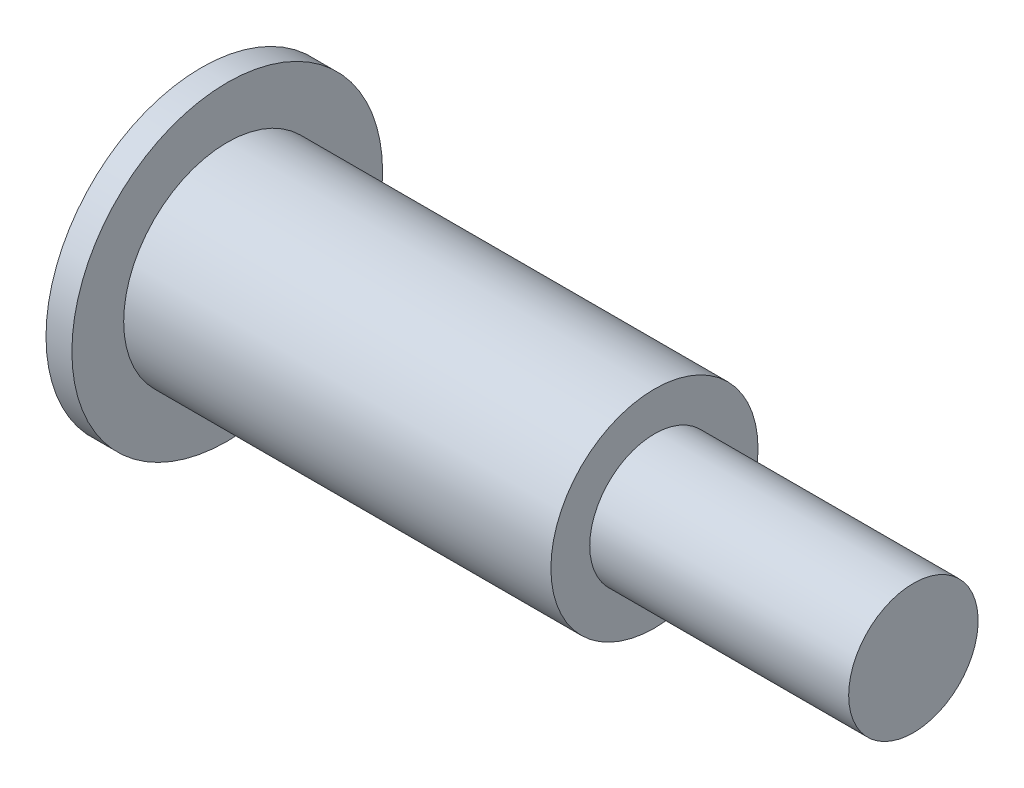
ISO-10303-21;
HEADER;
FILE_DESCRIPTION(('STEP AP214'),'2;1');
FILE_NAME('part.step','',(''),(''),'','','');
FILE_SCHEMA(('AUTOMOTIVE_DESIGN { 1 0 10303 214 1 1 1 1 }'));
ENDSEC;
DATA;
#1=APPLICATION_CONTEXT('core data for automotive mechanical design processes');
#2=APPLICATION_PROTOCOL_DEFINITION('international standard','automotive_design',2000,#1);
#3=PRODUCT_CONTEXT('',#1,'mechanical');
#4=PRODUCT('Part','Part','',(#3));
#5=PRODUCT_RELATED_PRODUCT_CATEGORY('part','',(#4));
#6=PRODUCT_DEFINITION_FORMATION('','',#4);
#7=PRODUCT_DEFINITION_CONTEXT('part definition',#1,'design');
#8=PRODUCT_DEFINITION('design','',#6,#7);
#9=PRODUCT_DEFINITION_SHAPE('','',#8);
#10=(LENGTH_UNIT() NAMED_UNIT(*) SI_UNIT(.MILLI.,.METRE.));
#11=(NAMED_UNIT(*) PLANE_ANGLE_UNIT() SI_UNIT($,.RADIAN.));
#12=(NAMED_UNIT(*) SI_UNIT($,.STERADIAN.) SOLID_ANGLE_UNIT());
#13=UNCERTAINTY_MEASURE_WITH_UNIT(LENGTH_MEASURE(1.E-05),#10,'distance_accuracy_value','');
#14=(GEOMETRIC_REPRESENTATION_CONTEXT(3) GLOBAL_UNCERTAINTY_ASSIGNED_CONTEXT((#13)) GLOBAL_UNIT_ASSIGNED_CONTEXT((#10,
#11,#12)) REPRESENTATION_CONTEXT('',''));
#15=CARTESIAN_POINT('',(0.,0.,0.));
#16=DIRECTION('',(0.,0.,1.));
#17=DIRECTION('',(1.,0.,0.));
#18=AXIS2_PLACEMENT_3D('',#15,#16,#17);
#19=CARTESIAN_POINT('',(0.,0.,0.));
#20=DIRECTION('',(1.,0.,0.));
#21=DIRECTION('',(0.,0.,-1.));
#22=AXIS2_PLACEMENT_3D('',#19,#20,#21);
#23=PLANE('',#22);
#24=CARTESIAN_POINT('',(0.,0.,0.));
#25=DIRECTION('',(-1.,0.,0.));
#26=DIRECTION('',(0.,0.,1.));
#27=AXIS2_PLACEMENT_3D('',#24,#25,#26);
#28=CIRCLE('',#27,6.);
#29=CARTESIAN_POINT('',(0.,0.,6.));
#30=VERTEX_POINT('',#29);
#31=EDGE_CURVE('E10',#30,#30,#28,.T.);
#32=ORIENTED_EDGE('',*,*,#31,.T.);
#33=EDGE_LOOP('',(#32));
#34=FACE_BOUND('',#33,.T.);
#35=ADVANCED_FACE('F29',(#34),#23,.F.);
#36=CARTESIAN_POINT('',(0.,0.,0.));
#37=DIRECTION('',(-1.,0.,0.));
#38=DIRECTION('',(0.,0.,1.));
#39=AXIS2_PLACEMENT_3D('',#36,#37,#38);
#40=CYLINDRICAL_SURFACE('',#39,6.);
#41=ORIENTED_EDGE('',*,*,#31,.F.);
#42=EDGE_LOOP('',(#41));
#43=FACE_BOUND('',#42,.T.);
#44=CARTESIAN_POINT('',(1.,0.,0.));
#45=DIRECTION('',(-1.,0.,0.));
#46=DIRECTION('',(0.,0.,1.));
#47=AXIS2_PLACEMENT_3D('',#44,#45,#46);
#48=CIRCLE('',#47,6.);
#49=CARTESIAN_POINT('',(1.,0.,6.));
#50=VERTEX_POINT('',#49);
#51=EDGE_CURVE('E35',#50,#50,#48,.T.);
#52=ORIENTED_EDGE('',*,*,#51,.T.);
#53=EDGE_LOOP('',(#52));
#54=FACE_BOUND('',#53,.T.);
#55=ADVANCED_FACE('F67',(#43,#54),#40,.T.);
#56=CARTESIAN_POINT('',(1.,6.,0.));
#57=DIRECTION('',(-1.,0.,0.));
#58=DIRECTION('',(0.,0.,1.));
#59=AXIS2_PLACEMENT_3D('',#56,#57,#58);
#60=PLANE('',#59);
#61=ORIENTED_EDGE('',*,*,#51,.F.);
#62=EDGE_LOOP('',(#61));
#63=FACE_BOUND('',#62,.T.);
#64=CARTESIAN_POINT('',(1.,0.,0.));
#65=DIRECTION('',(-1.,0.,0.));
#66=DIRECTION('',(0.,0.,1.));
#67=AXIS2_PLACEMENT_3D('',#64,#65,#66);
#68=CIRCLE('',#67,4.);
#69=CARTESIAN_POINT('',(1.,0.,4.));
#70=VERTEX_POINT('',#69);
#71=EDGE_CURVE('E39',#70,#70,#68,.T.);
#72=ORIENTED_EDGE('',*,*,#71,.T.);
#73=EDGE_LOOP('',(#72));
#74=FACE_BOUND('',#73,.T.);
#75=ADVANCED_FACE('F71',(#63,#74),#60,.F.);
#76=CARTESIAN_POINT('',(0.,0.,0.));
#77=DIRECTION('',(-1.,0.,0.));
#78=DIRECTION('',(0.,0.,1.));
#79=AXIS2_PLACEMENT_3D('',#76,#77,#78);
#80=CYLINDRICAL_SURFACE('',#79,4.);
#81=ORIENTED_EDGE('',*,*,#71,.F.);
#82=EDGE_LOOP('',(#81));
#83=FACE_BOUND('',#82,.T.);
#84=CARTESIAN_POINT('',(17.5,0.,0.));
#85=DIRECTION('',(-1.,0.,0.));
#86=DIRECTION('',(0.,0.,1.));
#87=AXIS2_PLACEMENT_3D('',#84,#85,#86);
#88=CIRCLE('',#87,4.);
#89=CARTESIAN_POINT('',(17.5,0.,4.));
#90=VERTEX_POINT('',#89);
#91=EDGE_CURVE('E43',#90,#90,#88,.T.);
#92=ORIENTED_EDGE('',*,*,#91,.T.);
#93=EDGE_LOOP('',(#92));
#94=FACE_BOUND('',#93,.T.);
#95=ADVANCED_FACE('F76',(#83,#94),#80,.T.);
#96=CARTESIAN_POINT('',(17.5,4.,0.));
#97=DIRECTION('',(-1.,0.,0.));
#98=DIRECTION('',(0.,0.,1.));
#99=AXIS2_PLACEMENT_3D('',#96,#97,#98);
#100=PLANE('',#99);
#101=ORIENTED_EDGE('',*,*,#91,.F.);
#102=EDGE_LOOP('',(#101));
#103=FACE_BOUND('',#102,.T.);
#104=CARTESIAN_POINT('',(17.5,0.,0.));
#105=DIRECTION('',(-1.,0.,0.));
#106=DIRECTION('',(0.,0.,1.));
#107=AXIS2_PLACEMENT_3D('',#104,#105,#106);
#108=CIRCLE('',#107,2.5);
#109=CARTESIAN_POINT('',(17.5,0.,2.5));
#110=VERTEX_POINT('',#109);
#111=EDGE_CURVE('E48',#110,#110,#108,.T.);
#112=ORIENTED_EDGE('',*,*,#111,.T.);
#113=EDGE_LOOP('',(#112));
#114=FACE_BOUND('',#113,.T.);
#115=ADVANCED_FACE('F63',(#103,#114),#100,.F.);
#116=CARTESIAN_POINT('',(0.,0.,0.));
#117=DIRECTION('',(-1.,0.,0.));
#118=DIRECTION('',(0.,0.,1.));
#119=AXIS2_PLACEMENT_3D('',#116,#117,#118);
#120=CYLINDRICAL_SURFACE('',#119,2.5);
#121=ORIENTED_EDGE('',*,*,#111,.F.);
#122=EDGE_LOOP('',(#121));
#123=FACE_BOUND('',#122,.T.);
#124=CARTESIAN_POINT('',(27.5,0.,0.));
#125=DIRECTION('',(-1.,0.,0.));
#126=DIRECTION('',(0.,0.,1.));
#127=AXIS2_PLACEMENT_3D('',#124,#125,#126);
#128=CIRCLE('',#127,2.5);
#129=CARTESIAN_POINT('',(27.5,0.,2.5));
#130=VERTEX_POINT('',#129);
#131=EDGE_CURVE('E51',#130,#130,#128,.T.);
#132=ORIENTED_EDGE('',*,*,#131,.T.);
#133=EDGE_LOOP('',(#132));
#134=FACE_BOUND('',#133,.T.);
#135=ADVANCED_FACE('F55',(#123,#134),#120,.T.);
#136=CARTESIAN_POINT('',(27.5,2.5,0.));
#137=DIRECTION('',(-1.,0.,0.));
#138=DIRECTION('',(0.,0.,1.));
#139=AXIS2_PLACEMENT_3D('',#136,#137,#138);
#140=PLANE('',#139);
#141=ORIENTED_EDGE('',*,*,#131,.F.);
#142=EDGE_LOOP('',(#141));
#143=FACE_BOUND('',#142,.T.);
#144=ADVANCED_FACE('F57',(#143),#140,.F.);
#145=CLOSED_SHELL('',(#35,#55,#75,#95,#115,#135,#144));
#146=MANIFOLD_SOLID_BREP('B2',#145);
#147=ADVANCED_BREP_SHAPE_REPRESENTATION('',(#18,#146),#14);
#148=SHAPE_DEFINITION_REPRESENTATION(#9,#147);
ENDSEC;
END-ISO-10303-21;
